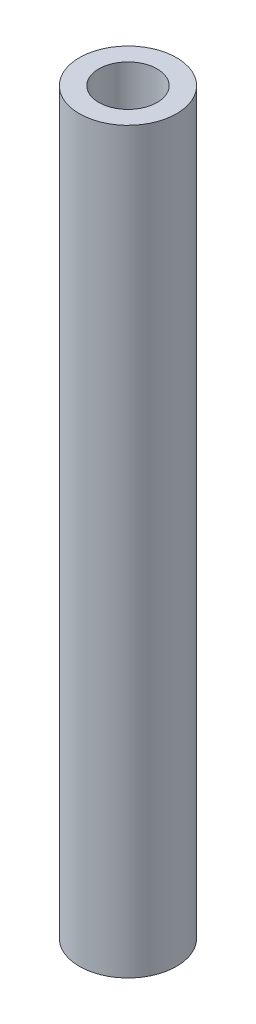
ISO-10303-21;
HEADER;
FILE_DESCRIPTION(('STEP AP214'),'2;1');
FILE_NAME('part.step','',(''),(''),'','','');
FILE_SCHEMA(('AUTOMOTIVE_DESIGN { 1 0 10303 214 1 1 1 1 }'));
ENDSEC;
DATA;
#1=APPLICATION_CONTEXT('core data for automotive mechanical design processes');
#2=APPLICATION_PROTOCOL_DEFINITION('international standard','automotive_design',2000,#1);
#3=PRODUCT_CONTEXT('',#1,'mechanical');
#4=PRODUCT('Part','Part','',(#3));
#5=PRODUCT_RELATED_PRODUCT_CATEGORY('part','',(#4));
#6=PRODUCT_DEFINITION_FORMATION('','',#4);
#7=PRODUCT_DEFINITION_CONTEXT('part definition',#1,'design');
#8=PRODUCT_DEFINITION('design','',#6,#7);
#9=PRODUCT_DEFINITION_SHAPE('','',#8);
#10=(LENGTH_UNIT() NAMED_UNIT(*) SI_UNIT(.MILLI.,.METRE.));
#11=(NAMED_UNIT(*) PLANE_ANGLE_UNIT() SI_UNIT($,.RADIAN.));
#12=(NAMED_UNIT(*) SI_UNIT($,.STERADIAN.) SOLID_ANGLE_UNIT());
#13=UNCERTAINTY_MEASURE_WITH_UNIT(LENGTH_MEASURE(1.E-05),#10,'distance_accuracy_value','');
#14=(GEOMETRIC_REPRESENTATION_CONTEXT(3) GLOBAL_UNCERTAINTY_ASSIGNED_CONTEXT((#13)) GLOBAL_UNIT_ASSIGNED_CONTEXT((#10,
#11,#12)) REPRESENTATION_CONTEXT('',''));
#15=CARTESIAN_POINT('',(0.,0.,0.));
#16=DIRECTION('',(0.,0.,1.));
#17=DIRECTION('',(1.,0.,0.));
#18=AXIS2_PLACEMENT_3D('',#15,#16,#17);
#19=CARTESIAN_POINT('',(0.,19.,0.));
#20=DIRECTION('',(0.,1.,0.));
#21=DIRECTION('',(0.,0.,1.));
#22=AXIS2_PLACEMENT_3D('',#19,#20,#21);
#23=PLANE('',#22);
#24=CARTESIAN_POINT('',(0.,19.,0.));
#25=DIRECTION('',(0.,1.,0.));
#26=DIRECTION('',(0.,0.,1.));
#27=AXIS2_PLACEMENT_3D('',#24,#25,#26);
#28=CIRCLE('',#27,2.5);
#29=CARTESIAN_POINT('',(0.,19.,2.5));
#30=VERTEX_POINT('',#29);
#31=EDGE_CURVE('E10',#30,#30,#28,.T.);
#32=ORIENTED_EDGE('',*,*,#31,.T.);
#33=EDGE_LOOP('',(#32));
#34=FACE_BOUND('',#33,.T.);
#35=CARTESIAN_POINT('',(0.,19.,0.));
#36=DIRECTION('',(0.,1.,0.));
#37=DIRECTION('',(0.,0.,1.));
#38=AXIS2_PLACEMENT_3D('',#35,#36,#37);
#39=CIRCLE('',#38,1.5);
#40=CARTESIAN_POINT('',(0.,19.,1.5));
#41=VERTEX_POINT('',#40);
#42=EDGE_CURVE('E43',#41,#41,#39,.T.);
#43=ORIENTED_EDGE('',*,*,#42,.F.);
#44=EDGE_LOOP('',(#43));
#45=FACE_BOUND('',#44,.T.);
#46=ADVANCED_FACE('F32',(#34,#45),#23,.T.);
#47=CARTESIAN_POINT('',(0.,-19.,0.));
#48=DIRECTION('',(0.,1.,0.));
#49=DIRECTION('',(0.,0.,1.));
#50=AXIS2_PLACEMENT_3D('',#47,#48,#49);
#51=PLANE('',#50);
#52=CARTESIAN_POINT('',(0.,-19.,0.));
#53=DIRECTION('',(0.,1.,0.));
#54=DIRECTION('',(0.,0.,1.));
#55=AXIS2_PLACEMENT_3D('',#52,#53,#54);
#56=CIRCLE('',#55,2.5);
#57=CARTESIAN_POINT('',(0.,-19.,2.5));
#58=VERTEX_POINT('',#57);
#59=EDGE_CURVE('E36',#58,#58,#56,.T.);
#60=ORIENTED_EDGE('',*,*,#59,.F.);
#61=EDGE_LOOP('',(#60));
#62=FACE_BOUND('',#61,.T.);
#63=CARTESIAN_POINT('',(0.,-19.,0.));
#64=DIRECTION('',(0.,1.,0.));
#65=DIRECTION('',(0.,0.,1.));
#66=AXIS2_PLACEMENT_3D('',#63,#64,#65);
#67=CIRCLE('',#66,1.5);
#68=CARTESIAN_POINT('',(0.,-19.,1.5));
#69=VERTEX_POINT('',#68);
#70=EDGE_CURVE('E45',#69,#69,#67,.T.);
#71=ORIENTED_EDGE('',*,*,#70,.T.);
#72=EDGE_LOOP('',(#71));
#73=FACE_BOUND('',#72,.T.);
#74=ADVANCED_FACE('F55',(#62,#73),#51,.F.);
#75=CARTESIAN_POINT('',(0.,19.,0.));
#76=DIRECTION('',(0.,-1.,0.));
#77=DIRECTION('',(0.,0.,-1.));
#78=AXIS2_PLACEMENT_3D('',#75,#76,#77);
#79=CYLINDRICAL_SURFACE('',#78,2.5);
#80=ORIENTED_EDGE('',*,*,#31,.F.);
#81=EDGE_LOOP('',(#80));
#82=FACE_BOUND('',#81,.T.);
#83=ORIENTED_EDGE('',*,*,#59,.T.);
#84=EDGE_LOOP('',(#83));
#85=FACE_BOUND('',#84,.T.);
#86=ADVANCED_FACE('F34',(#82,#85),#79,.T.);
#87=CARTESIAN_POINT('',(0.,19.,0.));
#88=DIRECTION('',(0.,-1.,0.));
#89=DIRECTION('',(0.,0.,-1.));
#90=AXIS2_PLACEMENT_3D('',#87,#88,#89);
#91=CYLINDRICAL_SURFACE('',#90,1.5);
#92=ORIENTED_EDGE('',*,*,#42,.T.);
#93=EDGE_LOOP('',(#92));
#94=FACE_BOUND('',#93,.T.);
#95=ORIENTED_EDGE('',*,*,#70,.F.);
#96=EDGE_LOOP('',(#95));
#97=FACE_BOUND('',#96,.T.);
#98=ADVANCED_FACE('F51',(#94,#97),#91,.F.);
#99=CLOSED_SHELL('',(#46,#74,#86,#98));
#100=MANIFOLD_SOLID_BREP('B2',#99);
#101=ADVANCED_BREP_SHAPE_REPRESENTATION('',(#18,#100),#14);
#102=SHAPE_DEFINITION_REPRESENTATION(#9,#101);
ENDSEC;
END-ISO-10303-21;
